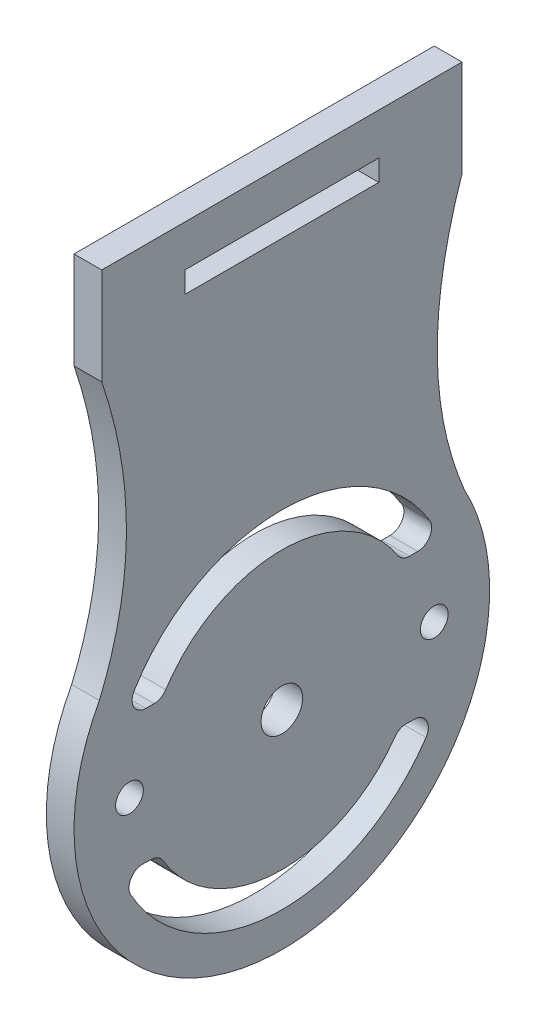
ISO-10303-21;
HEADER;
FILE_DESCRIPTION(('STEP AP214'),'2;1');
FILE_NAME('part.step','',(''),(''),'','','');
FILE_SCHEMA(('AUTOMOTIVE_DESIGN { 1 0 10303 214 1 1 1 1 }'));
ENDSEC;
DATA;
#1=APPLICATION_CONTEXT('core data for automotive mechanical design processes');
#2=APPLICATION_PROTOCOL_DEFINITION('international standard','automotive_design',2000,#1);
#3=PRODUCT_CONTEXT('',#1,'mechanical');
#4=PRODUCT('Part','Part','',(#3));
#5=PRODUCT_RELATED_PRODUCT_CATEGORY('part','',(#4));
#6=PRODUCT_DEFINITION_FORMATION('','',#4);
#7=PRODUCT_DEFINITION_CONTEXT('part definition',#1,'design');
#8=PRODUCT_DEFINITION('design','',#6,#7);
#9=PRODUCT_DEFINITION_SHAPE('','',#8);
#10=(LENGTH_UNIT() NAMED_UNIT(*) SI_UNIT(.MILLI.,.METRE.));
#11=(NAMED_UNIT(*) PLANE_ANGLE_UNIT() SI_UNIT($,.RADIAN.));
#12=(NAMED_UNIT(*) SI_UNIT($,.STERADIAN.) SOLID_ANGLE_UNIT());
#13=UNCERTAINTY_MEASURE_WITH_UNIT(LENGTH_MEASURE(1.E-05),#10,'distance_accuracy_value','');
#14=(GEOMETRIC_REPRESENTATION_CONTEXT(3) GLOBAL_UNCERTAINTY_ASSIGNED_CONTEXT((#13)) GLOBAL_UNIT_ASSIGNED_CONTEXT((#10,
#11,#12)) REPRESENTATION_CONTEXT('',''));
#15=CARTESIAN_POINT('',(0.,0.,0.));
#16=DIRECTION('',(0.,0.,1.));
#17=DIRECTION('',(1.,0.,0.));
#18=AXIS2_PLACEMENT_3D('',#15,#16,#17);
#19=CARTESIAN_POINT('',(2.,27.,13.));
#20=CARTESIAN_POINT('',(2.,16.2399641619766,9.3541994142272));
#21=CARTESIAN_POINT('',(2.,7.1726349857079,13.1739632366953));
#22=B_SPLINE_CURVE_WITH_KNOTS('',2,(#19,#20,#21),.UNSPECIFIED.,.F.,.F.,(3,3),(0.,
0.912495845409906),.UNSPECIFIED.);
#23=DIRECTION('',(-1.,0.,0.));
#24=VECTOR('',#23,1.);
#25=SURFACE_OF_LINEAR_EXTRUSION('',#22,#24);
#26=CARTESIAN_POINT('',(0.,27.,13.));
#27=CARTESIAN_POINT('',(0.,16.2399641619766,9.3541994142272));
#28=CARTESIAN_POINT('',(0.,7.1726349857079,13.1739632366953));
#29=B_SPLINE_CURVE_WITH_KNOTS('',2,(#26,#27,#28),.UNSPECIFIED.,.F.,.F.,(3,3),(0.,
0.912495845409906),.UNSPECIFIED.);
#30=CARTESIAN_POINT('',(0.,27.,13.));
#31=VERTEX_POINT('',#30);
#32=CARTESIAN_POINT('',(0.,7.1726349857079,13.1739632366953));
#33=VERTEX_POINT('',#32);
#34=EDGE_CURVE('E427',#31,#33,#29,.T.);
#35=ORIENTED_EDGE('',*,*,#34,.T.);
#36=DIRECTION('',(-1.,0.,0.));
#37=VECTOR('',#36,1.);
#38=CARTESIAN_POINT('',(2.,7.1726349857079,13.1739632366953));
#39=LINE('',#38,#37);
#40=CARTESIAN_POINT('',(2.,7.1726349857079,13.1739632366953));
#41=VERTEX_POINT('',#40);
#42=EDGE_CURVE('E11',#41,#33,#39,.T.);
#43=ORIENTED_EDGE('',*,*,#42,.F.);
#44=CARTESIAN_POINT('',(2.,27.,13.));
#45=VERTEX_POINT('',#44);
#46=EDGE_CURVE('E445',#45,#41,#22,.T.);
#47=ORIENTED_EDGE('',*,*,#46,.F.);
#48=DIRECTION('',(-1.,0.,0.));
#49=VECTOR('',#48,1.);
#50=CARTESIAN_POINT('',(2.,27.,13.));
#51=LINE('',#50,#49);
#52=EDGE_CURVE('E461',#45,#31,#51,.T.);
#53=ORIENTED_EDGE('',*,*,#52,.T.);
#54=EDGE_LOOP('',(#35,#43,#47,#53));
#55=FACE_BOUND('',#54,.T.);
#56=ADVANCED_FACE('F34',(#55),#25,.F.);
#57=CARTESIAN_POINT('',(2.,0.,0.));
#58=DIRECTION('',(-1.,0.,0.));
#59=DIRECTION('',(0.,0.,1.));
#60=AXIS2_PLACEMENT_3D('',#57,#58,#59);
#61=CYLINDRICAL_SURFACE('',#60,15.);
#62=CARTESIAN_POINT('',(0.,0.,0.));
#63=DIRECTION('',(1.,0.,0.));
#64=DIRECTION('',(0.,0.,-1.));
#65=AXIS2_PLACEMENT_3D('',#62,#63,#64);
#66=CIRCLE('',#65,15.);
#67=CARTESIAN_POINT('',(0.,7.1726349857079,-13.1739632366953));
#68=VERTEX_POINT('',#67);
#69=EDGE_CURVE('E418',#33,#68,#66,.T.);
#70=ORIENTED_EDGE('',*,*,#69,.T.);
#71=DIRECTION('',(-1.,0.,0.));
#72=VECTOR('',#71,1.);
#73=CARTESIAN_POINT('',(2.,7.1726349857079,-13.1739632366953));
#74=LINE('',#73,#72);
#75=CARTESIAN_POINT('',(2.,7.1726349857079,-13.1739632366953));
#76=VERTEX_POINT('',#75);
#77=EDGE_CURVE('E420',#76,#68,#74,.T.);
#78=ORIENTED_EDGE('',*,*,#77,.F.);
#79=CARTESIAN_POINT('',(2.,0.,0.));
#80=DIRECTION('',(1.,0.,0.));
#81=DIRECTION('',(0.,0.,-1.));
#82=AXIS2_PLACEMENT_3D('',#79,#80,#81);
#83=CIRCLE('',#82,15.);
#84=EDGE_CURVE('E451',#41,#76,#83,.T.);
#85=ORIENTED_EDGE('',*,*,#84,.F.);
#86=ORIENTED_EDGE('',*,*,#42,.T.);
#87=EDGE_LOOP('',(#70,#78,#85,#86));
#88=FACE_BOUND('',#87,.T.);
#89=ADVANCED_FACE('F409',(#88),#61,.T.);
#90=CARTESIAN_POINT('',(2.,34.,13.));
#91=DIRECTION('',(0.,-1.,0.));
#92=DIRECTION('',(0.,0.,-1.));
#93=AXIS2_PLACEMENT_3D('',#90,#91,#92);
#94=PLANE('',#93);
#95=DIRECTION('',(0.,0.,1.));
#96=VECTOR('',#95,1.);
#97=CARTESIAN_POINT('',(0.,34.,13.));
#98=LINE('',#97,#96);
#99=CARTESIAN_POINT('',(0.,34.,-13.));
#100=VERTEX_POINT('',#99);
#101=CARTESIAN_POINT('',(0.,34.,13.));
#102=VERTEX_POINT('',#101);
#103=EDGE_CURVE('E426',#100,#102,#98,.T.);
#104=ORIENTED_EDGE('',*,*,#103,.T.);
#105=DIRECTION('',(-1.,0.,0.));
#106=VECTOR('',#105,1.);
#107=CARTESIAN_POINT('',(2.,34.,13.));
#108=LINE('',#107,#106);
#109=CARTESIAN_POINT('',(2.,34.,13.));
#110=VERTEX_POINT('',#109);
#111=EDGE_CURVE('E42',#110,#102,#108,.T.);
#112=ORIENTED_EDGE('',*,*,#111,.F.);
#113=DIRECTION('',(0.,0.,1.));
#114=VECTOR('',#113,1.);
#115=CARTESIAN_POINT('',(2.,34.,13.));
#116=LINE('',#115,#114);
#117=CARTESIAN_POINT('',(2.,34.,-13.));
#118=VERTEX_POINT('',#117);
#119=EDGE_CURVE('E457',#118,#110,#116,.T.);
#120=ORIENTED_EDGE('',*,*,#119,.F.);
#121=DIRECTION('',(-1.,0.,0.));
#122=VECTOR('',#121,1.);
#123=CARTESIAN_POINT('',(2.,34.,-13.));
#124=LINE('',#123,#122);
#125=EDGE_CURVE('E432',#118,#100,#124,.T.);
#126=ORIENTED_EDGE('',*,*,#125,.T.);
#127=EDGE_LOOP('',(#104,#112,#120,#126));
#128=FACE_BOUND('',#127,.T.);
#129=ADVANCED_FACE('F406',(#128),#94,.F.);
#130=CARTESIAN_POINT('',(2.,34.,13.));
#131=DIRECTION('',(0.,0.,-1.));
#132=DIRECTION('',(0.,1.,0.));
#133=AXIS2_PLACEMENT_3D('',#130,#131,#132);
#134=PLANE('',#133);
#135=DIRECTION('',(0.,-1.,0.));
#136=VECTOR('',#135,1.);
#137=CARTESIAN_POINT('',(0.,34.,13.));
#138=LINE('',#137,#136);
#139=EDGE_CURVE('E452',#102,#31,#138,.T.);
#140=ORIENTED_EDGE('',*,*,#139,.T.);
#141=ORIENTED_EDGE('',*,*,#52,.F.);
#142=DIRECTION('',(0.,-1.,0.));
#143=VECTOR('',#142,1.);
#144=CARTESIAN_POINT('',(2.,34.,13.));
#145=LINE('',#144,#143);
#146=EDGE_CURVE('E459',#110,#45,#145,.T.);
#147=ORIENTED_EDGE('',*,*,#146,.F.);
#148=ORIENTED_EDGE('',*,*,#111,.T.);
#149=EDGE_LOOP('',(#140,#141,#147,#148));
#150=FACE_BOUND('',#149,.T.);
#151=ADVANCED_FACE('F399',(#150),#134,.F.);
#152=CARTESIAN_POINT('',(2.,16.6631408274153,11.2205905162874));
#153=DIRECTION('',(1.,0.,0.));
#154=DIRECTION('',(0.,0.,-1.));
#155=AXIS2_PLACEMENT_3D('',#152,#153,#154);
#156=PLANE('',#155);
#157=CARTESIAN_POINT('',(2.,0.,11.));
#158=DIRECTION('',(1.,0.,0.));
#159=DIRECTION('',(0.,0.,-1.));
#160=AXIS2_PLACEMENT_3D('',#157,#158,#159);
#161=CIRCLE('',#160,1.);
#162=CARTESIAN_POINT('',(2.,0.,10.));
#163=VERTEX_POINT('',#162);
#164=EDGE_CURVE('E581',#163,#163,#161,.T.);
#165=ORIENTED_EDGE('',*,*,#164,.F.);
#166=EDGE_LOOP('',(#165));
#167=FACE_BOUND('',#166,.T.);
#168=CARTESIAN_POINT('',(2.,0.,-11.));
#169=DIRECTION('',(1.,0.,0.));
#170=DIRECTION('',(0.,0.,-1.));
#171=AXIS2_PLACEMENT_3D('',#168,#169,#170);
#172=CIRCLE('',#171,1.);
#173=CARTESIAN_POINT('',(2.,0.,-12.));
#174=VERTEX_POINT('',#173);
#175=EDGE_CURVE('E583',#174,#174,#172,.T.);
#176=ORIENTED_EDGE('',*,*,#175,.F.);
#177=EDGE_LOOP('',(#176));
#178=FACE_BOUND('',#177,.T.);
#179=CARTESIAN_POINT('',(2.,0.,0.));
#180=DIRECTION('',(1.,0.,0.));
#181=DIRECTION('',(0.,0.,-1.));
#182=AXIS2_PLACEMENT_3D('',#179,#180,#181);
#183=CIRCLE('',#182,1.5);
#184=CARTESIAN_POINT('',(2.,0.,-1.5));
#185=VERTEX_POINT('',#184);
#186=EDGE_CURVE('E232',#185,#185,#183,.T.);
#187=ORIENTED_EDGE('',*,*,#186,.F.);
#188=EDGE_LOOP('',(#187));
#189=FACE_BOUND('',#188,.T.);
#190=CARTESIAN_POINT('',(2.,6.,-9.21954445729288));
#191=DIRECTION('',(1.,0.,0.));
#192=DIRECTION('',(0.,0.,1.));
#193=AXIS2_PLACEMENT_3D('',#190,#191,#192);
#194=CIRCLE('',#193,0.999999999999998);
#195=CARTESIAN_POINT('',(2.,5.45454545454546,-8.38140405208444));
#196=VERTEX_POINT('',#195);
#197=CARTESIAN_POINT('',(2.,5.,-9.21954445729289));
#198=VERTEX_POINT('',#197);
#199=EDGE_CURVE('E49',#196,#198,#194,.T.);
#200=ORIENTED_EDGE('',*,*,#199,.F.);
#201=CARTESIAN_POINT('',(2.,0.,0.));
#202=DIRECTION('',(-1.,0.,0.));
#203=DIRECTION('',(0.,0.,-1.));
#204=AXIS2_PLACEMENT_3D('',#201,#202,#203);
#205=CIRCLE('',#204,10.);
#206=CARTESIAN_POINT('',(2.,5.45454545454545,8.38140405208445));
#207=VERTEX_POINT('',#206);
#208=EDGE_CURVE('E226',#207,#196,#205,.T.);
#209=ORIENTED_EDGE('',*,*,#208,.F.);
#210=CARTESIAN_POINT('',(2.,6.,9.21954445729289));
#211=DIRECTION('',(1.,0.,0.));
#212=DIRECTION('',(0.,0.,-1.));
#213=AXIS2_PLACEMENT_3D('',#210,#211,#212);
#214=CIRCLE('',#213,1.);
#215=CARTESIAN_POINT('',(2.,5.,9.21954445729289));
#216=VERTEX_POINT('',#215);
#217=EDGE_CURVE('E229',#216,#207,#214,.T.);
#218=ORIENTED_EDGE('',*,*,#217,.F.);
#219=DIRECTION('',(0.,0.,-1.));
#220=VECTOR('',#219,1.);
#221=CARTESIAN_POINT('',(2.,5.,9.81070843517429));
#222=LINE('',#221,#220);
#223=CARTESIAN_POINT('',(2.,5.,9.81070843517429));
#224=VERTEX_POINT('',#223);
#225=EDGE_CURVE('E261',#224,#216,#222,.T.);
#226=ORIENTED_EDGE('',*,*,#225,.F.);
#227=CARTESIAN_POINT('',(2.,6.,9.81070843517429));
#228=DIRECTION('',(1.,0.,0.));
#229=DIRECTION('',(0.,0.,1.));
#230=AXIS2_PLACEMENT_3D('',#227,#228,#229);
#231=CIRCLE('',#230,1.);
#232=CARTESIAN_POINT('',(2.,6.52173913043478,10.6638135164938));
#233=VERTEX_POINT('',#232);
#234=EDGE_CURVE('E258',#233,#224,#231,.T.);
#235=ORIENTED_EDGE('',*,*,#234,.F.);
#236=CARTESIAN_POINT('',(2.,0.,0.));
#237=DIRECTION('',(1.,0.,0.));
#238=DIRECTION('',(0.,0.,-1.));
#239=AXIS2_PLACEMENT_3D('',#236,#237,#238);
#240=CIRCLE('',#239,12.5);
#241=CARTESIAN_POINT('',(2.,6.52173913043478,-10.6638135164938));
#242=VERTEX_POINT('',#241);
#243=EDGE_CURVE('E255',#242,#233,#240,.T.);
#244=ORIENTED_EDGE('',*,*,#243,.F.);
#245=CARTESIAN_POINT('',(2.,6.,-9.8107084351743));
#246=DIRECTION('',(1.,0.,0.));
#247=DIRECTION('',(0.,0.,-1.));
#248=AXIS2_PLACEMENT_3D('',#245,#246,#247);
#249=CIRCLE('',#248,0.999999999999999);
#250=CARTESIAN_POINT('',(2.,5.,-9.8107084351743));
#251=VERTEX_POINT('',#250);
#252=EDGE_CURVE('E252',#251,#242,#249,.T.);
#253=ORIENTED_EDGE('',*,*,#252,.F.);
#254=DIRECTION('',(0.,0.,-1.));
#255=VECTOR('',#254,1.);
#256=CARTESIAN_POINT('',(2.,5.,-9.21954445729288));
#257=LINE('',#256,#255);
#258=EDGE_CURVE('E249',#198,#251,#257,.T.);
#259=ORIENTED_EDGE('',*,*,#258,.F.);
#260=EDGE_LOOP('',(#200,#209,#218,#226,#235,#244,#253,#259));
#261=FACE_BOUND('',#260,.T.);
#262=CARTESIAN_POINT('',(2.,-5.63895967414048,9.44468812578888));
#263=DIRECTION('',(1.,0.,0.));
#264=DIRECTION('',(0.,0.,-1.));
#265=AXIS2_PLACEMENT_3D('',#262,#263,#264);
#266=CIRCLE('',#265,1.);
#267=CARTESIAN_POINT('',(2.,-5.12632697649135,8.58608011435353));
#268=VERTEX_POINT('',#267);
#269=CARTESIAN_POINT('',(2.,-4.6397077724395,9.40601466011852));
#270=VERTEX_POINT('',#269);
#271=EDGE_CURVE('E268',#268,#270,#266,.T.);
#272=ORIENTED_EDGE('',*,*,#271,.F.);
#273=CARTESIAN_POINT('',(2.,0.,0.));
#274=DIRECTION('',(-1.,0.,0.));
#275=DIRECTION('',(0.,0.,-1.));
#276=AXIS2_PLACEMENT_3D('',#273,#274,#275);
#277=CIRCLE('',#276,10.);
#278=CARTESIAN_POINT('',(2.,-5.77460286024672,-8.16418776158599));
#279=VERTEX_POINT('',#278);
#280=EDGE_CURVE('E284',#279,#268,#277,.T.);
#281=ORIENTED_EDGE('',*,*,#280,.F.);
#282=CARTESIAN_POINT('',(2.,-6.35206314627139,-8.98060653774459));
#283=DIRECTION('',(1.,0.,0.));
#284=DIRECTION('',(0.,0.,-1.));
#285=AXIS2_PLACEMENT_3D('',#282,#283,#284);
#286=CIRCLE('',#285,1.);
#287=CARTESIAN_POINT('',(2.,-5.3528112445704,-9.01928000341494));
#288=VERTEX_POINT('',#287);
#289=EDGE_CURVE('E322',#288,#279,#286,.T.);
#290=ORIENTED_EDGE('',*,*,#289,.F.);
#291=DIRECTION('',(0.,0.0386734656703576,0.999251901700989));
#292=VECTOR('',#291,1.);
#293=CARTESIAN_POINT('',(2.,-5.3528112445704,-9.01928000341494));
#294=LINE('',#293,#292);
#295=CARTESIAN_POINT('',(2.,-5.37567360437455,-9.61000173253006));
#296=VERTEX_POINT('',#295);
#297=EDGE_CURVE('E319',#296,#288,#294,.T.);
#298=ORIENTED_EDGE('',*,*,#297,.F.);
#299=CARTESIAN_POINT('',(2.,-6.37492550607554,-9.5713282668597));
#300=DIRECTION('',(1.,0.,0.));
#301=DIRECTION('',(0.,0.,-1.));
#302=AXIS2_PLACEMENT_3D('',#299,#300,#301);
#303=CIRCLE('',#302,1.);
#304=CARTESIAN_POINT('',(2.,-6.92926685442993,-10.4036176813692));
#305=VERTEX_POINT('',#304);
#306=EDGE_CURVE('E316',#305,#296,#303,.T.);
#307=ORIENTED_EDGE('',*,*,#306,.F.);
#308=CARTESIAN_POINT('',(2.,0.,0.));
#309=DIRECTION('',(1.,0.,0.));
#310=DIRECTION('',(0.,0.,-1.));
#311=AXIS2_PLACEMENT_3D('',#308,#309,#310);
#312=CIRCLE('',#311,12.5);
#313=CARTESIAN_POINT('',(2.,-6.10445360253949,10.908054190113));
#314=VERTEX_POINT('',#313);
#315=EDGE_CURVE('E313',#314,#305,#312,.T.);
#316=ORIENTED_EDGE('',*,*,#315,.F.);
#317=CARTESIAN_POINT('',(2.,-5.61609731433633,10.035409854904));
#318=DIRECTION('',(1.,0.,0.));
#319=DIRECTION('',(0.,0.,-1.));
#320=AXIS2_PLACEMENT_3D('',#317,#318,#319);
#321=CIRCLE('',#320,0.999999999999999);
#322=CARTESIAN_POINT('',(2.,-4.61684541263534,9.99673638923364));
#323=VERTEX_POINT('',#322);
#324=EDGE_CURVE('E310',#323,#314,#321,.T.);
#325=ORIENTED_EDGE('',*,*,#324,.F.);
#326=DIRECTION('',(0.,0.0386734656703574,0.999251901700989));
#327=VECTOR('',#326,1.);
#328=CARTESIAN_POINT('',(2.,-4.61684541263534,9.99673638923364));
#329=LINE('',#328,#327);
#330=EDGE_CURVE('E307',#270,#323,#329,.T.);
#331=ORIENTED_EDGE('',*,*,#330,.F.);
#332=EDGE_LOOP('',(#272,#281,#290,#298,#307,#316,#325,#331));
#333=FACE_BOUND('',#332,.T.);
#334=DIRECTION('',(0.,1.,0.));
#335=VECTOR('',#334,1.);
#336=CARTESIAN_POINT('',(2.,31.,-6.99999999999997));
#337=LINE('',#336,#335);
#338=CARTESIAN_POINT('',(2.,29.4721192150516,-6.99999999999997));
#339=VERTEX_POINT('',#338);
#340=CARTESIAN_POINT('',(2.,31.,-6.99999999999997));
#341=VERTEX_POINT('',#340);
#342=EDGE_CURVE('E329',#339,#341,#337,.T.);
#343=ORIENTED_EDGE('',*,*,#342,.F.);
#344=DIRECTION('',(0.,0.,-1.));
#345=VECTOR('',#344,1.);
#346=CARTESIAN_POINT('',(2.,29.4721192150516,7.00000000000003));
#347=LINE('',#346,#345);
#348=CARTESIAN_POINT('',(2.,29.4721192150516,7.00000000000003));
#349=VERTEX_POINT('',#348);
#350=EDGE_CURVE('E348',#349,#339,#347,.T.);
#351=ORIENTED_EDGE('',*,*,#350,.F.);
#352=DIRECTION('',(0.,-1.,0.));
#353=VECTOR('',#352,1.);
#354=CARTESIAN_POINT('',(2.,31.,7.00000000000003));
#355=LINE('',#354,#353);
#356=CARTESIAN_POINT('',(2.,31.,7.00000000000003));
#357=VERTEX_POINT('',#356);
#358=EDGE_CURVE('E362',#357,#349,#355,.T.);
#359=ORIENTED_EDGE('',*,*,#358,.F.);
#360=DIRECTION('',(0.,0.,1.));
#361=VECTOR('',#360,1.);
#362=CARTESIAN_POINT('',(2.,31.,7.00000000000003));
#363=LINE('',#362,#361);
#364=EDGE_CURVE('E359',#341,#357,#363,.T.);
#365=ORIENTED_EDGE('',*,*,#364,.F.);
#366=EDGE_LOOP('',(#343,#351,#359,#365));
#367=FACE_BOUND('',#366,.T.);
#368=ORIENTED_EDGE('',*,*,#46,.T.);
#369=ORIENTED_EDGE('',*,*,#84,.T.);
#370=CARTESIAN_POINT('',(2.,27.,-13.));
#371=CARTESIAN_POINT('',(2.,16.2399641619766,-9.3541994142272));
#372=CARTESIAN_POINT('',(2.,7.1726349857079,-13.1739632366953));
#373=B_SPLINE_CURVE_WITH_KNOTS('',2,(#370,#371,#372),.UNSPECIFIED.,.F.,.F.,(3,3),(0.,
0.912495845409906),.UNSPECIFIED.);
#374=CARTESIAN_POINT('',(2.,27.,-13.));
#375=VERTEX_POINT('',#374);
#376=EDGE_CURVE('E376',#375,#76,#373,.T.);
#377=ORIENTED_EDGE('',*,*,#376,.F.);
#378=DIRECTION('',(0.,-1.,0.));
#379=VECTOR('',#378,1.);
#380=CARTESIAN_POINT('',(2.,34.,-13.));
#381=LINE('',#380,#379);
#382=EDGE_CURVE('E382',#118,#375,#381,.T.);
#383=ORIENTED_EDGE('',*,*,#382,.F.);
#384=ORIENTED_EDGE('',*,*,#119,.T.);
#385=ORIENTED_EDGE('',*,*,#146,.T.);
#386=EDGE_LOOP('',(#368,#369,#377,#383,#384,#385));
#387=FACE_BOUND('',#386,.T.);
#388=ADVANCED_FACE('F396',(#167,#178,#189,#261,#333,#367,#387),#156,.T.);
#389=CARTESIAN_POINT('',(0.,16.6631408274153,11.2205905162874));
#390=DIRECTION('',(1.,0.,0.));
#391=DIRECTION('',(0.,0.,-1.));
#392=AXIS2_PLACEMENT_3D('',#389,#390,#391);
#393=PLANE('',#392);
#394=CARTESIAN_POINT('',(0.,0.,11.));
#395=DIRECTION('',(1.,0.,0.));
#396=DIRECTION('',(0.,0.,-1.));
#397=AXIS2_PLACEMENT_3D('',#394,#395,#396);
#398=CIRCLE('',#397,1.);
#399=CARTESIAN_POINT('',(0.,0.,10.));
#400=VERTEX_POINT('',#399);
#401=EDGE_CURVE('E578',#400,#400,#398,.T.);
#402=ORIENTED_EDGE('',*,*,#401,.T.);
#403=EDGE_LOOP('',(#402));
#404=FACE_BOUND('',#403,.T.);
#405=CARTESIAN_POINT('',(0.,0.,-11.));
#406=DIRECTION('',(1.,0.,0.));
#407=DIRECTION('',(0.,0.,-1.));
#408=AXIS2_PLACEMENT_3D('',#405,#406,#407);
#409=CIRCLE('',#408,1.);
#410=CARTESIAN_POINT('',(0.,0.,-12.));
#411=VERTEX_POINT('',#410);
#412=EDGE_CURVE('E586',#411,#411,#409,.T.);
#413=ORIENTED_EDGE('',*,*,#412,.T.);
#414=EDGE_LOOP('',(#413));
#415=FACE_BOUND('',#414,.T.);
#416=CARTESIAN_POINT('',(0.,0.,0.));
#417=DIRECTION('',(1.,0.,0.));
#418=DIRECTION('',(0.,0.,-1.));
#419=AXIS2_PLACEMENT_3D('',#416,#417,#418);
#420=CIRCLE('',#419,1.5);
#421=CARTESIAN_POINT('',(0.,0.,-1.5));
#422=VERTEX_POINT('',#421);
#423=EDGE_CURVE('E250',#422,#422,#420,.T.);
#424=ORIENTED_EDGE('',*,*,#423,.T.);
#425=EDGE_LOOP('',(#424));
#426=FACE_BOUND('',#425,.T.);
#427=CARTESIAN_POINT('',(0.,0.,0.));
#428=DIRECTION('',(-1.,0.,0.));
#429=DIRECTION('',(0.,0.,-1.));
#430=AXIS2_PLACEMENT_3D('',#427,#428,#429);
#431=CIRCLE('',#430,10.);
#432=CARTESIAN_POINT('',(0.,5.45454545454545,8.38140405208445));
#433=VERTEX_POINT('',#432);
#434=CARTESIAN_POINT('',(0.,5.45454545454546,-8.38140405208444));
#435=VERTEX_POINT('',#434);
#436=EDGE_CURVE('E215',#433,#435,#431,.T.);
#437=ORIENTED_EDGE('',*,*,#436,.T.);
#438=CARTESIAN_POINT('',(0.,6.,-9.21954445729288));
#439=DIRECTION('',(1.,0.,0.));
#440=DIRECTION('',(0.,0.,1.));
#441=AXIS2_PLACEMENT_3D('',#438,#439,#440);
#442=CIRCLE('',#441,0.999999999999998);
#443=CARTESIAN_POINT('',(0.,5.,-9.21954445729288));
#444=VERTEX_POINT('',#443);
#445=EDGE_CURVE('E209',#435,#444,#442,.T.);
#446=ORIENTED_EDGE('',*,*,#445,.T.);
#447=DIRECTION('',(0.,0.,-1.));
#448=VECTOR('',#447,1.);
#449=CARTESIAN_POINT('',(0.,5.,-9.21954445729288));
#450=LINE('',#449,#448);
#451=CARTESIAN_POINT('',(0.,5.,-9.81070843517429));
#452=VERTEX_POINT('',#451);
#453=EDGE_CURVE('E218',#444,#452,#450,.T.);
#454=ORIENTED_EDGE('',*,*,#453,.T.);
#455=CARTESIAN_POINT('',(0.,6.,-9.8107084351743));
#456=DIRECTION('',(1.,0.,0.));
#457=DIRECTION('',(0.,0.,-1.));
#458=AXIS2_PLACEMENT_3D('',#455,#456,#457);
#459=CIRCLE('',#458,0.999999999999999);
#460=CARTESIAN_POINT('',(0.,6.52173913043478,-10.6638135164938));
#461=VERTEX_POINT('',#460);
#462=EDGE_CURVE('E57',#452,#461,#459,.T.);
#463=ORIENTED_EDGE('',*,*,#462,.T.);
#464=CARTESIAN_POINT('',(0.,0.,0.));
#465=DIRECTION('',(1.,0.,0.));
#466=DIRECTION('',(0.,0.,-1.));
#467=AXIS2_PLACEMENT_3D('',#464,#465,#466);
#468=CIRCLE('',#467,12.5);
#469=CARTESIAN_POINT('',(0.,6.52173913043478,10.6638135164938));
#470=VERTEX_POINT('',#469);
#471=EDGE_CURVE('E236',#461,#470,#468,.T.);
#472=ORIENTED_EDGE('',*,*,#471,.T.);
#473=CARTESIAN_POINT('',(0.,6.,9.81070843517429));
#474=DIRECTION('',(1.,0.,0.));
#475=DIRECTION('',(0.,0.,1.));
#476=AXIS2_PLACEMENT_3D('',#473,#474,#475);
#477=CIRCLE('',#476,1.);
#478=CARTESIAN_POINT('',(0.,5.,9.81070843517429));
#479=VERTEX_POINT('',#478);
#480=EDGE_CURVE('E239',#470,#479,#477,.T.);
#481=ORIENTED_EDGE('',*,*,#480,.T.);
#482=DIRECTION('',(0.,0.,-1.));
#483=VECTOR('',#482,1.);
#484=CARTESIAN_POINT('',(0.,5.,9.81070843517429));
#485=LINE('',#484,#483);
#486=CARTESIAN_POINT('',(0.,5.,9.21954445729289));
#487=VERTEX_POINT('',#486);
#488=EDGE_CURVE('E242',#479,#487,#485,.T.);
#489=ORIENTED_EDGE('',*,*,#488,.T.);
#490=CARTESIAN_POINT('',(0.,6.,9.21954445729289));
#491=DIRECTION('',(1.,0.,0.));
#492=DIRECTION('',(0.,0.,-1.));
#493=AXIS2_PLACEMENT_3D('',#490,#491,#492);
#494=CIRCLE('',#493,1.);
#495=EDGE_CURVE('E245',#487,#433,#494,.T.);
#496=ORIENTED_EDGE('',*,*,#495,.T.);
#497=EDGE_LOOP('',(#437,#446,#454,#463,#472,#481,#489,#496));
#498=FACE_BOUND('',#497,.T.);
#499=CARTESIAN_POINT('',(0.,0.,0.));
#500=DIRECTION('',(-1.,0.,0.));
#501=DIRECTION('',(0.,0.,-1.));
#502=AXIS2_PLACEMENT_3D('',#499,#500,#501);
#503=CIRCLE('',#502,10.);
#504=CARTESIAN_POINT('',(0.,-5.77460286024672,-8.16418776158599));
#505=VERTEX_POINT('',#504);
#506=CARTESIAN_POINT('',(0.,-5.12632697649135,8.58608011435353));
#507=VERTEX_POINT('',#506);
#508=EDGE_CURVE('E302',#505,#507,#503,.T.);
#509=ORIENTED_EDGE('',*,*,#508,.T.);
#510=CARTESIAN_POINT('',(0.,-5.63895967414048,9.44468812578888));
#511=DIRECTION('',(1.,0.,0.));
#512=DIRECTION('',(0.,0.,-1.));
#513=AXIS2_PLACEMENT_3D('',#510,#511,#512);
#514=CIRCLE('',#513,1.);
#515=CARTESIAN_POINT('',(0.,-4.63970777243949,9.40601466011852));
#516=VERTEX_POINT('',#515);
#517=EDGE_CURVE('E280',#507,#516,#514,.T.);
#518=ORIENTED_EDGE('',*,*,#517,.T.);
#519=DIRECTION('',(0.,0.0386734656703574,0.999251901700989));
#520=VECTOR('',#519,1.);
#521=CARTESIAN_POINT('',(0.,-4.61684541263534,9.99673638923364));
#522=LINE('',#521,#520);
#523=CARTESIAN_POINT('',(0.,-4.61684541263535,9.99673638923364));
#524=VERTEX_POINT('',#523);
#525=EDGE_CURVE('E283',#516,#524,#522,.T.);
#526=ORIENTED_EDGE('',*,*,#525,.T.);
#527=CARTESIAN_POINT('',(0.,-5.61609731433633,10.035409854904));
#528=DIRECTION('',(1.,0.,0.));
#529=DIRECTION('',(0.,0.,-1.));
#530=AXIS2_PLACEMENT_3D('',#527,#528,#529);
#531=CIRCLE('',#530,0.999999999999999);
#532=CARTESIAN_POINT('',(0.,-6.10445360253949,10.908054190113));
#533=VERTEX_POINT('',#532);
#534=EDGE_CURVE('E287',#524,#533,#531,.T.);
#535=ORIENTED_EDGE('',*,*,#534,.T.);
#536=CARTESIAN_POINT('',(0.,0.,0.));
#537=DIRECTION('',(1.,0.,0.));
#538=DIRECTION('',(0.,0.,-1.));
#539=AXIS2_PLACEMENT_3D('',#536,#537,#538);
#540=CIRCLE('',#539,12.5);
#541=CARTESIAN_POINT('',(0.,-6.92926685442993,-10.4036176813692));
#542=VERTEX_POINT('',#541);
#543=EDGE_CURVE('E290',#533,#542,#540,.T.);
#544=ORIENTED_EDGE('',*,*,#543,.T.);
#545=CARTESIAN_POINT('',(0.,-6.37492550607554,-9.5713282668597));
#546=DIRECTION('',(1.,0.,0.));
#547=DIRECTION('',(0.,0.,-1.));
#548=AXIS2_PLACEMENT_3D('',#545,#546,#547);
#549=CIRCLE('',#548,1.);
#550=CARTESIAN_POINT('',(0.,-5.37567360437455,-9.61000173253006));
#551=VERTEX_POINT('',#550);
#552=EDGE_CURVE('E293',#542,#551,#549,.T.);
#553=ORIENTED_EDGE('',*,*,#552,.T.);
#554=DIRECTION('',(0.,0.0386734656703576,0.999251901700989));
#555=VECTOR('',#554,1.);
#556=CARTESIAN_POINT('',(0.,-5.3528112445704,-9.01928000341494));
#557=LINE('',#556,#555);
#558=CARTESIAN_POINT('',(0.,-5.3528112445704,-9.01928000341494));
#559=VERTEX_POINT('',#558);
#560=EDGE_CURVE('E296',#551,#559,#557,.T.);
#561=ORIENTED_EDGE('',*,*,#560,.T.);
#562=CARTESIAN_POINT('',(0.,-6.35206314627139,-8.98060653774459));
#563=DIRECTION('',(1.,0.,0.));
#564=DIRECTION('',(0.,0.,-1.));
#565=AXIS2_PLACEMENT_3D('',#562,#563,#564);
#566=CIRCLE('',#565,1.);
#567=EDGE_CURVE('E299',#559,#505,#566,.T.);
#568=ORIENTED_EDGE('',*,*,#567,.T.);
#569=EDGE_LOOP('',(#509,#518,#526,#535,#544,#553,#561,#568));
#570=FACE_BOUND('',#569,.T.);
#571=DIRECTION('',(0.,0.,-1.));
#572=VECTOR('',#571,1.);
#573=CARTESIAN_POINT('',(0.,29.4721192150516,7.00000000000003));
#574=LINE('',#573,#572);
#575=CARTESIAN_POINT('',(0.,29.4721192150516,7.00000000000003));
#576=VERTEX_POINT('',#575);
#577=CARTESIAN_POINT('',(0.,29.4721192150516,-6.99999999999997));
#578=VERTEX_POINT('',#577);
#579=EDGE_CURVE('E354',#576,#578,#574,.T.);
#580=ORIENTED_EDGE('',*,*,#579,.T.);
#581=DIRECTION('',(0.,1.,0.));
#582=VECTOR('',#581,1.);
#583=CARTESIAN_POINT('',(0.,31.,-6.99999999999997));
#584=LINE('',#583,#582);
#585=CARTESIAN_POINT('',(0.,31.,-6.99999999999997));
#586=VERTEX_POINT('',#585);
#587=EDGE_CURVE('E344',#578,#586,#584,.T.);
#588=ORIENTED_EDGE('',*,*,#587,.T.);
#589=DIRECTION('',(0.,0.,1.));
#590=VECTOR('',#589,1.);
#591=CARTESIAN_POINT('',(0.,31.,7.00000000000003));
#592=LINE('',#591,#590);
#593=CARTESIAN_POINT('',(0.,31.,7.00000000000003));
#594=VERTEX_POINT('',#593);
#595=EDGE_CURVE('E347',#586,#594,#592,.T.);
#596=ORIENTED_EDGE('',*,*,#595,.T.);
#597=DIRECTION('',(0.,-1.,0.));
#598=VECTOR('',#597,1.);
#599=CARTESIAN_POINT('',(0.,31.,7.00000000000003));
#600=LINE('',#599,#598);
#601=EDGE_CURVE('E351',#594,#576,#600,.T.);
#602=ORIENTED_EDGE('',*,*,#601,.T.);
#603=EDGE_LOOP('',(#580,#588,#596,#602));
#604=FACE_BOUND('',#603,.T.);
#605=ORIENTED_EDGE('',*,*,#34,.F.);
#606=ORIENTED_EDGE('',*,*,#139,.F.);
#607=ORIENTED_EDGE('',*,*,#103,.F.);
#608=DIRECTION('',(0.,-1.,0.));
#609=VECTOR('',#608,1.);
#610=CARTESIAN_POINT('',(0.,34.,-13.));
#611=LINE('',#610,#609);
#612=CARTESIAN_POINT('',(0.,27.,-13.));
#613=VERTEX_POINT('',#612);
#614=EDGE_CURVE('E383',#100,#613,#611,.T.);
#615=ORIENTED_EDGE('',*,*,#614,.T.);
#616=CARTESIAN_POINT('',(0.,27.,-13.));
#617=CARTESIAN_POINT('',(0.,16.2399641619766,-9.3541994142272));
#618=CARTESIAN_POINT('',(0.,7.1726349857079,-13.1739632366953));
#619=B_SPLINE_CURVE_WITH_KNOTS('',2,(#616,#617,#618),.UNSPECIFIED.,.F.,.F.,(3,3),(0.,
0.912495845409906),.UNSPECIFIED.);
#620=EDGE_CURVE('E369',#613,#68,#619,.T.);
#621=ORIENTED_EDGE('',*,*,#620,.T.);
#622=ORIENTED_EDGE('',*,*,#69,.F.);
#623=EDGE_LOOP('',(#605,#606,#607,#615,#621,#622));
#624=FACE_BOUND('',#623,.T.);
#625=ADVANCED_FACE('F222',(#404,#415,#426,#498,#570,#604,#624),#393,.F.);
#626=DIRECTION('',(-1.,0.,0.));
#627=VECTOR('',#626,1.);
#628=SURFACE_OF_LINEAR_EXTRUSION('',#373,#627);
#629=ORIENTED_EDGE('',*,*,#620,.F.);
#630=DIRECTION('',(-1.,0.,0.));
#631=VECTOR('',#630,1.);
#632=CARTESIAN_POINT('',(2.,27.,-13.));
#633=LINE('',#632,#631);
#634=EDGE_CURVE('E444',#375,#613,#633,.T.);
#635=ORIENTED_EDGE('',*,*,#634,.F.);
#636=ORIENTED_EDGE('',*,*,#376,.T.);
#637=ORIENTED_EDGE('',*,*,#77,.T.);
#638=EDGE_LOOP('',(#629,#635,#636,#637));
#639=FACE_BOUND('',#638,.T.);
#640=ADVANCED_FACE('F389',(#639),#628,.T.);
#641=CARTESIAN_POINT('',(2.,34.,-13.));
#642=DIRECTION('',(0.,0.,-1.));
#643=DIRECTION('',(0.,1.,0.));
#644=AXIS2_PLACEMENT_3D('',#641,#642,#643);
#645=PLANE('',#644);
#646=ORIENTED_EDGE('',*,*,#614,.F.);
#647=ORIENTED_EDGE('',*,*,#125,.F.);
#648=ORIENTED_EDGE('',*,*,#382,.T.);
#649=ORIENTED_EDGE('',*,*,#634,.T.);
#650=EDGE_LOOP('',(#646,#647,#648,#649));
#651=FACE_BOUND('',#650,.T.);
#652=ADVANCED_FACE('F393',(#651),#645,.T.);
#653=CARTESIAN_POINT('',(0.,31.,-6.99999999999997));
#654=DIRECTION('',(0.,0.,-1.));
#655=DIRECTION('',(0.,1.,0.));
#656=AXIS2_PLACEMENT_3D('',#653,#654,#655);
#657=PLANE('',#656);
#658=ORIENTED_EDGE('',*,*,#342,.T.);
#659=DIRECTION('',(1.,0.,0.));
#660=VECTOR('',#659,1.);
#661=CARTESIAN_POINT('',(0.,31.,-6.99999999999997));
#662=LINE('',#661,#660);
#663=EDGE_CURVE('E357',#586,#341,#662,.T.);
#664=ORIENTED_EDGE('',*,*,#663,.F.);
#665=ORIENTED_EDGE('',*,*,#587,.F.);
#666=DIRECTION('',(1.,0.,0.));
#667=VECTOR('',#666,1.);
#668=CARTESIAN_POINT('',(0.,29.4721192150516,-6.99999999999997));
#669=LINE('',#668,#667);
#670=EDGE_CURVE('E367',#578,#339,#669,.T.);
#671=ORIENTED_EDGE('',*,*,#670,.T.);
#672=EDGE_LOOP('',(#658,#664,#665,#671));
#673=FACE_BOUND('',#672,.T.);
#674=ADVANCED_FACE('F483',(#673),#657,.F.);
#675=CARTESIAN_POINT('',(0.,29.4721192150516,7.00000000000003));
#676=DIRECTION('',(0.,-1.,0.));
#677=DIRECTION('',(0.,0.,-1.));
#678=AXIS2_PLACEMENT_3D('',#675,#676,#677);
#679=PLANE('',#678);
#680=ORIENTED_EDGE('',*,*,#350,.T.);
#681=ORIENTED_EDGE('',*,*,#670,.F.);
#682=ORIENTED_EDGE('',*,*,#579,.F.);
#683=DIRECTION('',(1.,0.,0.));
#684=VECTOR('',#683,1.);
#685=CARTESIAN_POINT('',(0.,29.4721192150516,7.00000000000003));
#686=LINE('',#685,#684);
#687=EDGE_CURVE('E370',#576,#349,#686,.T.);
#688=ORIENTED_EDGE('',*,*,#687,.T.);
#689=EDGE_LOOP('',(#680,#681,#682,#688));
#690=FACE_BOUND('',#689,.T.);
#691=ADVANCED_FACE('F487',(#690),#679,.F.);
#692=CARTESIAN_POINT('',(0.,31.,7.00000000000003));
#693=DIRECTION('',(0.,0.,1.));
#694=DIRECTION('',(1.,0.,0.));
#695=AXIS2_PLACEMENT_3D('',#692,#693,#694);
#696=PLANE('',#695);
#697=ORIENTED_EDGE('',*,*,#358,.T.);
#698=ORIENTED_EDGE('',*,*,#687,.F.);
#699=ORIENTED_EDGE('',*,*,#601,.F.);
#700=DIRECTION('',(1.,0.,0.));
#701=VECTOR('',#700,1.);
#702=CARTESIAN_POINT('',(0.,31.,7.00000000000003));
#703=LINE('',#702,#701);
#704=EDGE_CURVE('E372',#594,#357,#703,.T.);
#705=ORIENTED_EDGE('',*,*,#704,.T.);
#706=EDGE_LOOP('',(#697,#698,#699,#705));
#707=FACE_BOUND('',#706,.T.);
#708=ADVANCED_FACE('F492',(#707),#696,.F.);
#709=CARTESIAN_POINT('',(0.,31.,7.00000000000003));
#710=DIRECTION('',(0.,1.,0.));
#711=DIRECTION('',(0.,0.,1.));
#712=AXIS2_PLACEMENT_3D('',#709,#710,#711);
#713=PLANE('',#712);
#714=ORIENTED_EDGE('',*,*,#364,.T.);
#715=ORIENTED_EDGE('',*,*,#704,.F.);
#716=ORIENTED_EDGE('',*,*,#595,.F.);
#717=ORIENTED_EDGE('',*,*,#663,.T.);
#718=EDGE_LOOP('',(#714,#715,#716,#717));
#719=FACE_BOUND('',#718,.T.);
#720=ADVANCED_FACE('F496',(#719),#713,.F.);
#721=CARTESIAN_POINT('',(0.,-5.63895967414048,9.44468812578888));
#722=DIRECTION('',(1.,0.,0.));
#723=DIRECTION('',(0.,0.,-1.));
#724=AXIS2_PLACEMENT_3D('',#721,#722,#723);
#725=CYLINDRICAL_SURFACE('',#724,1.);
#726=ORIENTED_EDGE('',*,*,#271,.T.);
#727=DIRECTION('',(1.,0.,0.));
#728=VECTOR('',#727,1.);
#729=CARTESIAN_POINT('',(0.,-4.63970777243949,9.40601466011852));
#730=LINE('',#729,#728);
#731=EDGE_CURVE('E305',#516,#270,#730,.T.);
#732=ORIENTED_EDGE('',*,*,#731,.F.);
#733=ORIENTED_EDGE('',*,*,#517,.F.);
#734=DIRECTION('',(1.,0.,0.));
#735=VECTOR('',#734,1.);
#736=CARTESIAN_POINT('',(0.,-5.12632697649135,8.58608011435353));
#737=LINE('',#736,#735);
#738=EDGE_CURVE('E327',#507,#268,#737,.T.);
#739=ORIENTED_EDGE('',*,*,#738,.T.);
#740=EDGE_LOOP('',(#726,#732,#733,#739));
#741=FACE_BOUND('',#740,.T.);
#742=ADVANCED_FACE('F499',(#741),#725,.F.);
#743=CARTESIAN_POINT('',(0.,0.,0.));
#744=DIRECTION('',(1.,0.,0.));
#745=DIRECTION('',(0.,0.,-1.));
#746=AXIS2_PLACEMENT_3D('',#743,#744,#745);
#747=CYLINDRICAL_SURFACE('',#746,10.);
#748=ORIENTED_EDGE('',*,*,#280,.T.);
#749=ORIENTED_EDGE('',*,*,#738,.F.);
#750=ORIENTED_EDGE('',*,*,#508,.F.);
#751=DIRECTION('',(1.,0.,0.));
#752=VECTOR('',#751,1.);
#753=CARTESIAN_POINT('',(0.,-5.77460286024672,-8.16418776158599));
#754=LINE('',#753,#752);
#755=EDGE_CURVE('E330',#505,#279,#754,.T.);
#756=ORIENTED_EDGE('',*,*,#755,.T.);
#757=EDGE_LOOP('',(#748,#749,#750,#756));
#758=FACE_BOUND('',#757,.T.);
#759=ADVANCED_FACE('F506',(#758),#747,.T.);
#760=CARTESIAN_POINT('',(0.,-6.35206314627139,-8.98060653774459));
#761=DIRECTION('',(1.,0.,0.));
#762=DIRECTION('',(0.,0.,-1.));
#763=AXIS2_PLACEMENT_3D('',#760,#761,#762);
#764=CYLINDRICAL_SURFACE('',#763,1.);
#765=ORIENTED_EDGE('',*,*,#289,.T.);
#766=ORIENTED_EDGE('',*,*,#755,.F.);
#767=ORIENTED_EDGE('',*,*,#567,.F.);
#768=DIRECTION('',(1.,0.,0.));
#769=VECTOR('',#768,1.);
#770=CARTESIAN_POINT('',(0.,-5.3528112445704,-9.01928000341494));
#771=LINE('',#770,#769);
#772=EDGE_CURVE('E332',#559,#288,#771,.T.);
#773=ORIENTED_EDGE('',*,*,#772,.T.);
#774=EDGE_LOOP('',(#765,#766,#767,#773));
#775=FACE_BOUND('',#774,.T.);
#776=ADVANCED_FACE('F527',(#775),#764,.F.);
#777=CARTESIAN_POINT('',(0.,-5.3528112445704,-9.01928000341494));
#778=DIRECTION('',(0.,0.999251901700989,-0.0386734656703576));
#779=DIRECTION('',(0.,0.0386734656703576,0.99925190170099));
#780=AXIS2_PLACEMENT_3D('',#777,#778,#779);
#781=PLANE('',#780);
#782=ORIENTED_EDGE('',*,*,#297,.T.);
#783=ORIENTED_EDGE('',*,*,#772,.F.);
#784=ORIENTED_EDGE('',*,*,#560,.F.);
#785=DIRECTION('',(1.,0.,0.));
#786=VECTOR('',#785,1.);
#787=CARTESIAN_POINT('',(0.,-5.37567360437455,-9.61000173253006));
#788=LINE('',#787,#786);
#789=EDGE_CURVE('E334',#551,#296,#788,.T.);
#790=ORIENTED_EDGE('',*,*,#789,.T.);
#791=EDGE_LOOP('',(#782,#783,#784,#790));
#792=FACE_BOUND('',#791,.T.);
#793=ADVANCED_FACE('F523',(#792),#781,.F.);
#794=CARTESIAN_POINT('',(0.,-6.37492550607554,-9.5713282668597));
#795=DIRECTION('',(1.,0.,0.));
#796=DIRECTION('',(0.,0.,-1.));
#797=AXIS2_PLACEMENT_3D('',#794,#795,#796);
#798=CYLINDRICAL_SURFACE('',#797,1.);
#799=ORIENTED_EDGE('',*,*,#306,.T.);
#800=ORIENTED_EDGE('',*,*,#789,.F.);
#801=ORIENTED_EDGE('',*,*,#552,.F.);
#802=DIRECTION('',(1.,0.,0.));
#803=VECTOR('',#802,1.);
#804=CARTESIAN_POINT('',(0.,-6.92926685442993,-10.4036176813692));
#805=LINE('',#804,#803);
#806=EDGE_CURVE('E336',#542,#305,#805,.T.);
#807=ORIENTED_EDGE('',*,*,#806,.T.);
#808=EDGE_LOOP('',(#799,#800,#801,#807));
#809=FACE_BOUND('',#808,.T.);
#810=ADVANCED_FACE('F519',(#809),#798,.F.);
#811=CARTESIAN_POINT('',(0.,0.,0.));
#812=DIRECTION('',(1.,0.,0.));
#813=DIRECTION('',(0.,0.,-1.));
#814=AXIS2_PLACEMENT_3D('',#811,#812,#813);
#815=CYLINDRICAL_SURFACE('',#814,12.5);
#816=ORIENTED_EDGE('',*,*,#315,.T.);
#817=ORIENTED_EDGE('',*,*,#806,.F.);
#818=ORIENTED_EDGE('',*,*,#543,.F.);
#819=DIRECTION('',(1.,0.,0.));
#820=VECTOR('',#819,1.);
#821=CARTESIAN_POINT('',(0.,-6.10445360253949,10.908054190113));
#822=LINE('',#821,#820);
#823=EDGE_CURVE('E338',#533,#314,#822,.T.);
#824=ORIENTED_EDGE('',*,*,#823,.T.);
#825=EDGE_LOOP('',(#816,#817,#818,#824));
#826=FACE_BOUND('',#825,.T.);
#827=ADVANCED_FACE('F515',(#826),#815,.F.);
#828=CARTESIAN_POINT('',(0.,-5.61609731433633,10.035409854904));
#829=DIRECTION('',(1.,0.,0.));
#830=DIRECTION('',(0.,0.,-1.));
#831=AXIS2_PLACEMENT_3D('',#828,#829,#830);
#832=CYLINDRICAL_SURFACE('',#831,0.999999999999999);
#833=ORIENTED_EDGE('',*,*,#324,.T.);
#834=ORIENTED_EDGE('',*,*,#823,.F.);
#835=ORIENTED_EDGE('',*,*,#534,.F.);
#836=DIRECTION('',(1.,0.,0.));
#837=VECTOR('',#836,1.);
#838=CARTESIAN_POINT('',(0.,-4.61684541263534,9.99673638923364));
#839=LINE('',#838,#837);
#840=EDGE_CURVE('E340',#524,#323,#839,.T.);
#841=ORIENTED_EDGE('',*,*,#840,.T.);
#842=EDGE_LOOP('',(#833,#834,#835,#841));
#843=FACE_BOUND('',#842,.T.);
#844=ADVANCED_FACE('F511',(#843),#832,.F.);
#845=CARTESIAN_POINT('',(0.,-4.61684541263534,9.99673638923364));
#846=DIRECTION('',(0.,0.999251901700989,-0.0386734656703574));
#847=DIRECTION('',(0.,0.0386734656703574,0.99925190170099));
#848=AXIS2_PLACEMENT_3D('',#845,#846,#847);
#849=PLANE('',#848);
#850=ORIENTED_EDGE('',*,*,#330,.T.);
#851=ORIENTED_EDGE('',*,*,#840,.F.);
#852=ORIENTED_EDGE('',*,*,#525,.F.);
#853=ORIENTED_EDGE('',*,*,#731,.T.);
#854=EDGE_LOOP('',(#850,#851,#852,#853));
#855=FACE_BOUND('',#854,.T.);
#856=ADVANCED_FACE('F508',(#855),#849,.F.);
#857=CARTESIAN_POINT('',(0.,6.,-9.21954445729288));
#858=DIRECTION('',(1.,0.,0.));
#859=DIRECTION('',(0.,0.,-1.));
#860=AXIS2_PLACEMENT_3D('',#857,#858,#859);
#861=CYLINDRICAL_SURFACE('',#860,0.999999999999998);
#862=ORIENTED_EDGE('',*,*,#199,.T.);
#863=DIRECTION('',(1.,0.,0.));
#864=VECTOR('',#863,1.);
#865=CARTESIAN_POINT('',(0.,5.,-9.21954445729288));
#866=LINE('',#865,#864);
#867=EDGE_CURVE('E205',#444,#198,#866,.T.);
#868=ORIENTED_EDGE('',*,*,#867,.F.);
#869=ORIENTED_EDGE('',*,*,#445,.F.);
#870=DIRECTION('',(1.,0.,0.));
#871=VECTOR('',#870,1.);
#872=CARTESIAN_POINT('',(0.,5.45454545454546,-8.38140405208444));
#873=LINE('',#872,#871);
#874=EDGE_CURVE('E266',#435,#196,#873,.T.);
#875=ORIENTED_EDGE('',*,*,#874,.T.);
#876=EDGE_LOOP('',(#862,#868,#869,#875));
#877=FACE_BOUND('',#876,.T.);
#878=ADVANCED_FACE('F207',(#877),#861,.F.);
#879=CARTESIAN_POINT('',(0.,0.,0.));
#880=DIRECTION('',(1.,0.,0.));
#881=DIRECTION('',(0.,0.,-1.));
#882=AXIS2_PLACEMENT_3D('',#879,#880,#881);
#883=CYLINDRICAL_SURFACE('',#882,10.);
#884=ORIENTED_EDGE('',*,*,#208,.T.);
#885=ORIENTED_EDGE('',*,*,#874,.F.);
#886=ORIENTED_EDGE('',*,*,#436,.F.);
#887=DIRECTION('',(1.,0.,0.));
#888=VECTOR('',#887,1.);
#889=CARTESIAN_POINT('',(0.,5.45454545454545,8.38140405208445));
#890=LINE('',#889,#888);
#891=EDGE_CURVE('E269',#433,#207,#890,.T.);
#892=ORIENTED_EDGE('',*,*,#891,.T.);
#893=EDGE_LOOP('',(#884,#885,#886,#892));
#894=FACE_BOUND('',#893,.T.);
#895=ADVANCED_FACE('F537',(#894),#883,.T.);
#896=CARTESIAN_POINT('',(0.,6.,9.21954445729289));
#897=DIRECTION('',(1.,0.,0.));
#898=DIRECTION('',(0.,0.,-1.));
#899=AXIS2_PLACEMENT_3D('',#896,#897,#898);
#900=CYLINDRICAL_SURFACE('',#899,1.);
#901=ORIENTED_EDGE('',*,*,#217,.T.);
#902=ORIENTED_EDGE('',*,*,#891,.F.);
#903=ORIENTED_EDGE('',*,*,#495,.F.);
#904=DIRECTION('',(1.,0.,0.));
#905=VECTOR('',#904,1.);
#906=CARTESIAN_POINT('',(0.,5.,9.21954445729289));
#907=LINE('',#906,#905);
#908=EDGE_CURVE('E271',#487,#216,#907,.T.);
#909=ORIENTED_EDGE('',*,*,#908,.T.);
#910=EDGE_LOOP('',(#901,#902,#903,#909));
#911=FACE_BOUND('',#910,.T.);
#912=ADVANCED_FACE('F555',(#911),#900,.F.);
#913=CARTESIAN_POINT('',(0.,5.,9.81070843517429));
#914=DIRECTION('',(0.,-1.,0.));
#915=DIRECTION('',(0.,0.,-1.));
#916=AXIS2_PLACEMENT_3D('',#913,#914,#915);
#917=PLANE('',#916);
#918=ORIENTED_EDGE('',*,*,#225,.T.);
#919=ORIENTED_EDGE('',*,*,#908,.F.);
#920=ORIENTED_EDGE('',*,*,#488,.F.);
#921=DIRECTION('',(1.,0.,0.));
#922=VECTOR('',#921,1.);
#923=CARTESIAN_POINT('',(0.,5.,9.81070843517429));
#924=LINE('',#923,#922);
#925=EDGE_CURVE('E273',#479,#224,#924,.T.);
#926=ORIENTED_EDGE('',*,*,#925,.T.);
#927=EDGE_LOOP('',(#918,#919,#920,#926));
#928=FACE_BOUND('',#927,.T.);
#929=ADVANCED_FACE('F551',(#928),#917,.F.);
#930=CARTESIAN_POINT('',(0.,6.,9.81070843517429));
#931=DIRECTION('',(1.,0.,0.));
#932=DIRECTION('',(0.,0.,-1.));
#933=AXIS2_PLACEMENT_3D('',#930,#931,#932);
#934=CYLINDRICAL_SURFACE('',#933,1.);
#935=ORIENTED_EDGE('',*,*,#234,.T.);
#936=ORIENTED_EDGE('',*,*,#925,.F.);
#937=ORIENTED_EDGE('',*,*,#480,.F.);
#938=DIRECTION('',(1.,0.,0.));
#939=VECTOR('',#938,1.);
#940=CARTESIAN_POINT('',(0.,6.52173913043478,10.6638135164938));
#941=LINE('',#940,#939);
#942=EDGE_CURVE('E275',#470,#233,#941,.T.);
#943=ORIENTED_EDGE('',*,*,#942,.T.);
#944=EDGE_LOOP('',(#935,#936,#937,#943));
#945=FACE_BOUND('',#944,.T.);
#946=ADVANCED_FACE('F547',(#945),#934,.F.);
#947=CARTESIAN_POINT('',(0.,0.,0.));
#948=DIRECTION('',(1.,0.,0.));
#949=DIRECTION('',(0.,0.,-1.));
#950=AXIS2_PLACEMENT_3D('',#947,#948,#949);
#951=CYLINDRICAL_SURFACE('',#950,12.5);
#952=ORIENTED_EDGE('',*,*,#243,.T.);
#953=ORIENTED_EDGE('',*,*,#942,.F.);
#954=ORIENTED_EDGE('',*,*,#471,.F.);
#955=DIRECTION('',(1.,0.,0.));
#956=VECTOR('',#955,1.);
#957=CARTESIAN_POINT('',(0.,6.52173913043478,-10.6638135164938));
#958=LINE('',#957,#956);
#959=EDGE_CURVE('E277',#461,#242,#958,.T.);
#960=ORIENTED_EDGE('',*,*,#959,.T.);
#961=EDGE_LOOP('',(#952,#953,#954,#960));
#962=FACE_BOUND('',#961,.T.);
#963=ADVANCED_FACE('F544',(#962),#951,.F.);
#964=CARTESIAN_POINT('',(0.,6.,-9.8107084351743));
#965=DIRECTION('',(1.,0.,0.));
#966=DIRECTION('',(0.,0.,-1.));
#967=AXIS2_PLACEMENT_3D('',#964,#965,#966);
#968=CYLINDRICAL_SURFACE('',#967,0.999999999999999);
#969=ORIENTED_EDGE('',*,*,#252,.T.);
#970=ORIENTED_EDGE('',*,*,#959,.F.);
#971=ORIENTED_EDGE('',*,*,#462,.F.);
#972=DIRECTION('',(1.,0.,0.));
#973=VECTOR('',#972,1.);
#974=CARTESIAN_POINT('',(0.,5.,-9.8107084351743));
#975=LINE('',#974,#973);
#976=EDGE_CURVE('E214',#452,#251,#975,.T.);
#977=ORIENTED_EDGE('',*,*,#976,.T.);
#978=EDGE_LOOP('',(#969,#970,#971,#977));
#979=FACE_BOUND('',#978,.T.);
#980=ADVANCED_FACE('F541',(#979),#968,.F.);
#981=CARTESIAN_POINT('',(0.,5.,-9.21954445729288));
#982=DIRECTION('',(0.,-1.,0.));
#983=DIRECTION('',(0.,0.,-1.));
#984=AXIS2_PLACEMENT_3D('',#981,#982,#983);
#985=PLANE('',#984);
#986=ORIENTED_EDGE('',*,*,#258,.T.);
#987=ORIENTED_EDGE('',*,*,#976,.F.);
#988=ORIENTED_EDGE('',*,*,#453,.F.);
#989=ORIENTED_EDGE('',*,*,#867,.T.);
#990=EDGE_LOOP('',(#986,#987,#988,#989));
#991=FACE_BOUND('',#990,.T.);
#992=ADVANCED_FACE('F219',(#991),#985,.F.);
#993=CARTESIAN_POINT('',(0.,0.,0.));
#994=DIRECTION('',(1.,0.,0.));
#995=DIRECTION('',(0.,0.,-1.));
#996=AXIS2_PLACEMENT_3D('',#993,#994,#995);
#997=CYLINDRICAL_SURFACE('',#996,1.5);
#998=ORIENTED_EDGE('',*,*,#423,.F.);
#999=EDGE_LOOP('',(#998));
#1000=FACE_BOUND('',#999,.T.);
#1001=ORIENTED_EDGE('',*,*,#186,.T.);
#1002=EDGE_LOOP('',(#1001));
#1003=FACE_BOUND('',#1002,.T.);
#1004=ADVANCED_FACE('F540',(#1000,#1003),#997,.F.);
#1005=CARTESIAN_POINT('',(0.,0.,-11.));
#1006=DIRECTION('',(1.,0.,0.));
#1007=DIRECTION('',(0.,0.,-1.));
#1008=AXIS2_PLACEMENT_3D('',#1005,#1006,#1007);
#1009=CYLINDRICAL_SURFACE('',#1008,1.);
#1010=ORIENTED_EDGE('',*,*,#412,.F.);
#1011=EDGE_LOOP('',(#1010));
#1012=FACE_BOUND('',#1011,.T.);
#1013=ORIENTED_EDGE('',*,*,#175,.T.);
#1014=EDGE_LOOP('',(#1013));
#1015=FACE_BOUND('',#1014,.T.);
#1016=ADVANCED_FACE('F565',(#1012,#1015),#1009,.F.);
#1017=CARTESIAN_POINT('',(0.,0.,11.));
#1018=DIRECTION('',(1.,0.,0.));
#1019=DIRECTION('',(0.,0.,-1.));
#1020=AXIS2_PLACEMENT_3D('',#1017,#1018,#1019);
#1021=CYLINDRICAL_SURFACE('',#1020,1.);
#1022=ORIENTED_EDGE('',*,*,#401,.F.);
#1023=EDGE_LOOP('',(#1022));
#1024=FACE_BOUND('',#1023,.T.);
#1025=ORIENTED_EDGE('',*,*,#164,.T.);
#1026=EDGE_LOOP('',(#1025));
#1027=FACE_BOUND('',#1026,.T.);
#1028=ADVANCED_FACE('F569',(#1024,#1027),#1021,.F.);
#1029=CLOSED_SHELL('',(#56,#89,#129,#151,#388,#625,#640,#652,#674,#691,#708,#720,#742,#759,#776,
#793,#810,#827,#844,#856,#878,#895,#912,#929,#946,#963,#980,#992,#1004,#1016,#1028));
#1030=MANIFOLD_SOLID_BREP('B2',#1029);
#1031=ADVANCED_BREP_SHAPE_REPRESENTATION('',(#18,#1030),#14);
#1032=SHAPE_DEFINITION_REPRESENTATION(#9,#1031);
ENDSEC;
END-ISO-10303-21;
